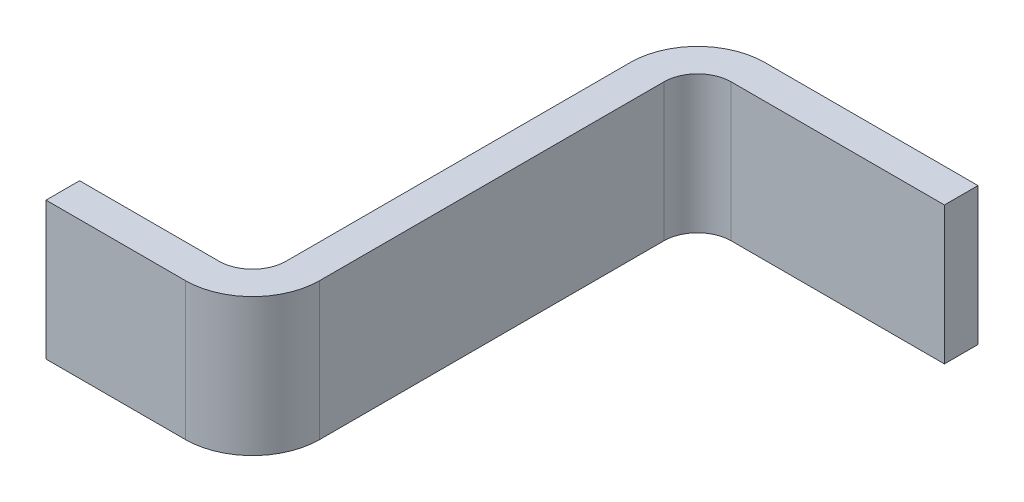
ISO-10303-21;
HEADER;
FILE_DESCRIPTION(('STEP AP214'),'2;1');
FILE_NAME('part.step','',(''),(''),'','','');
FILE_SCHEMA(('AUTOMOTIVE_DESIGN { 1 0 10303 214 1 1 1 1 }'));
ENDSEC;
DATA;
#1=APPLICATION_CONTEXT('core data for automotive mechanical design processes');
#2=APPLICATION_PROTOCOL_DEFINITION('international standard','automotive_design',2000,#1);
#3=PRODUCT_CONTEXT('',#1,'mechanical');
#4=PRODUCT('Part','Part','',(#3));
#5=PRODUCT_RELATED_PRODUCT_CATEGORY('part','',(#4));
#6=PRODUCT_DEFINITION_FORMATION('','',#4);
#7=PRODUCT_DEFINITION_CONTEXT('part definition',#1,'design');
#8=PRODUCT_DEFINITION('design','',#6,#7);
#9=PRODUCT_DEFINITION_SHAPE('','',#8);
#10=(LENGTH_UNIT() NAMED_UNIT(*) SI_UNIT(.MILLI.,.METRE.));
#11=(NAMED_UNIT(*) PLANE_ANGLE_UNIT() SI_UNIT($,.RADIAN.));
#12=(NAMED_UNIT(*) SI_UNIT($,.STERADIAN.) SOLID_ANGLE_UNIT());
#13=UNCERTAINTY_MEASURE_WITH_UNIT(LENGTH_MEASURE(1.E-05),#10,'distance_accuracy_value','');
#14=(GEOMETRIC_REPRESENTATION_CONTEXT(3) GLOBAL_UNCERTAINTY_ASSIGNED_CONTEXT((#13)) GLOBAL_UNIT_ASSIGNED_CONTEXT((#10,
#11,#12)) REPRESENTATION_CONTEXT('',''));
#15=CARTESIAN_POINT('',(0.,0.,0.));
#16=DIRECTION('',(0.,0.,1.));
#17=DIRECTION('',(1.,0.,0.));
#18=AXIS2_PLACEMENT_3D('',#15,#16,#17);
#19=CARTESIAN_POINT('',(0.,0.205,1.425));
#20=DIRECTION('',(0.,0.,-1.));
#21=DIRECTION('',(-1.,0.,0.));
#22=AXIS2_PLACEMENT_3D('',#19,#20,#21);
#23=PLANE('',#22);
#24=DIRECTION('',(1.,0.,0.));
#25=VECTOR('',#24,1.);
#26=CARTESIAN_POINT('',(0.,0.205,1.425));
#27=LINE('',#26,#25);
#28=CARTESIAN_POINT('',(0.415,0.205,1.425));
#29=VERTEX_POINT('',#28);
#30=CARTESIAN_POINT('',(0.,0.205,1.425));
#31=VERTEX_POINT('',#30);
#32=EDGE_CURVE('E85',#29,#31,#27,.F.);
#33=ORIENTED_EDGE('',*,*,#32,.T.);
#34=DIRECTION('',(0.,1.,0.));
#35=VECTOR('',#34,1.);
#36=CARTESIAN_POINT('',(0.,-0.205,1.425));
#37=LINE('',#36,#35);
#38=CARTESIAN_POINT('',(0.,-0.205,1.425));
#39=VERTEX_POINT('',#38);
#40=EDGE_CURVE('E111',#39,#31,#37,.T.);
#41=ORIENTED_EDGE('',*,*,#40,.F.);
#42=DIRECTION('',(1.,0.,0.));
#43=VECTOR('',#42,1.);
#44=CARTESIAN_POINT('',(0.,-0.205,1.425));
#45=LINE('',#44,#43);
#46=CARTESIAN_POINT('',(0.415,-0.205,1.425));
#47=VERTEX_POINT('',#46);
#48=EDGE_CURVE('E130',#39,#47,#45,.T.);
#49=ORIENTED_EDGE('',*,*,#48,.T.);
#50=DIRECTION('',(0.,1.,0.));
#51=VECTOR('',#50,1.);
#52=CARTESIAN_POINT('',(0.415,0.205,1.425));
#53=LINE('',#52,#51);
#54=EDGE_CURVE('E121',#29,#47,#53,.F.);
#55=ORIENTED_EDGE('',*,*,#54,.F.);
#56=EDGE_LOOP('',(#33,#41,#49,#55));
#57=FACE_BOUND('',#56,.T.);
#58=ADVANCED_FACE('F17',(#57),#23,.F.);
#59=CARTESIAN_POINT('',(0.715,0.205,0.1));
#60=DIRECTION('',(0.,0.,-1.));
#61=DIRECTION('',(-1.,0.,0.));
#62=AXIS2_PLACEMENT_3D('',#59,#60,#61);
#63=PLANE('',#62);
#64=DIRECTION('',(1.,0.,0.));
#65=VECTOR('',#64,1.);
#66=CARTESIAN_POINT('',(0.715,0.205,0.1));
#67=LINE('',#66,#65);
#68=CARTESIAN_POINT('',(1.35,0.205,0.1));
#69=VERTEX_POINT('',#68);
#70=CARTESIAN_POINT('',(0.715,0.205,0.1));
#71=VERTEX_POINT('',#70);
#72=EDGE_CURVE('E142',#69,#71,#67,.F.);
#73=ORIENTED_EDGE('',*,*,#72,.T.);
#74=DIRECTION('',(0.,-1.,0.));
#75=VECTOR('',#74,1.);
#76=CARTESIAN_POINT('',(0.715,0.205,0.1));
#77=LINE('',#76,#75);
#78=CARTESIAN_POINT('',(0.715,-0.205,0.1));
#79=VERTEX_POINT('',#78);
#80=EDGE_CURVE('E189',#71,#79,#77,.T.);
#81=ORIENTED_EDGE('',*,*,#80,.T.);
#82=DIRECTION('',(1.,0.,0.));
#83=VECTOR('',#82,1.);
#84=CARTESIAN_POINT('',(0.715,-0.205,0.1));
#85=LINE('',#84,#83);
#86=CARTESIAN_POINT('',(1.35,-0.205,0.1));
#87=VERTEX_POINT('',#86);
#88=EDGE_CURVE('E193',#79,#87,#85,.T.);
#89=ORIENTED_EDGE('',*,*,#88,.T.);
#90=DIRECTION('',(0.,1.,0.));
#91=VECTOR('',#90,1.);
#92=CARTESIAN_POINT('',(1.35,-0.205,0.1));
#93=LINE('',#92,#91);
#94=EDGE_CURVE('E96',#87,#69,#93,.T.);
#95=ORIENTED_EDGE('',*,*,#94,.T.);
#96=EDGE_LOOP('',(#73,#81,#89,#95));
#97=FACE_BOUND('',#96,.T.);
#98=ADVANCED_FACE('F230',(#97),#63,.F.);
#99=CARTESIAN_POINT('',(0.,-0.205,1.325));
#100=DIRECTION('',(-1.,0.,0.));
#101=DIRECTION('',(0.,0.,1.));
#102=AXIS2_PLACEMENT_3D('',#99,#100,#101);
#103=PLANE('',#102);
#104=DIRECTION('',(0.,0.,1.));
#105=VECTOR('',#104,1.);
#106=CARTESIAN_POINT('',(0.,0.205,1.325));
#107=LINE('',#106,#105);
#108=CARTESIAN_POINT('',(0.,0.205,1.325));
#109=VERTEX_POINT('',#108);
#110=EDGE_CURVE('E114',#31,#109,#107,.F.);
#111=ORIENTED_EDGE('',*,*,#110,.T.);
#112=DIRECTION('',(0.,1.,0.));
#113=VECTOR('',#112,1.);
#114=CARTESIAN_POINT('',(0.,-0.205,1.325));
#115=LINE('',#114,#113);
#116=CARTESIAN_POINT('',(0.,-0.205,1.325));
#117=VERTEX_POINT('',#116);
#118=EDGE_CURVE('E175',#109,#117,#115,.F.);
#119=ORIENTED_EDGE('',*,*,#118,.T.);
#120=DIRECTION('',(0.,0.,1.));
#121=VECTOR('',#120,1.);
#122=CARTESIAN_POINT('',(0.,-0.205,1.425));
#123=LINE('',#122,#121);
#124=EDGE_CURVE('E116',#117,#39,#123,.T.);
#125=ORIENTED_EDGE('',*,*,#124,.T.);
#126=ORIENTED_EDGE('',*,*,#40,.T.);
#127=EDGE_LOOP('',(#111,#119,#125,#126));
#128=FACE_BOUND('',#127,.T.);
#129=ADVANCED_FACE('F112',(#128),#103,.T.);
#130=CARTESIAN_POINT('',(0.415,0.205,1.225));
#131=DIRECTION('',(0.,1.,0.));
#132=DIRECTION('',(0.,0.,1.));
#133=AXIS2_PLACEMENT_3D('',#130,#131,#132);
#134=CYLINDRICAL_SURFACE('',#133,0.2);
#135=CARTESIAN_POINT('',(0.415,0.205,1.225));
#136=DIRECTION('',(0.,1.,0.));
#137=DIRECTION('',(0.,0.,1.));
#138=AXIS2_PLACEMENT_3D('',#135,#136,#137);
#139=CIRCLE('',#138,0.2);
#140=CARTESIAN_POINT('',(0.615,0.205,1.225));
#141=VERTEX_POINT('',#140);
#142=EDGE_CURVE('E20',#29,#141,#139,.T.);
#143=ORIENTED_EDGE('',*,*,#142,.F.);
#144=ORIENTED_EDGE('',*,*,#54,.T.);
#145=CARTESIAN_POINT('',(0.415,-0.205,1.225));
#146=DIRECTION('',(0.,1.,0.));
#147=DIRECTION('',(0.,0.,1.));
#148=AXIS2_PLACEMENT_3D('',#145,#146,#147);
#149=CIRCLE('',#148,0.2);
#150=CARTESIAN_POINT('',(0.615,-0.205,1.225));
#151=VERTEX_POINT('',#150);
#152=EDGE_CURVE('E166',#151,#47,#149,.F.);
#153=ORIENTED_EDGE('',*,*,#152,.F.);
#154=DIRECTION('',(0.,1.,0.));
#155=VECTOR('',#154,1.);
#156=CARTESIAN_POINT('',(0.615,0.205,1.225));
#157=LINE('',#156,#155);
#158=EDGE_CURVE('E168',#151,#141,#157,.T.);
#159=ORIENTED_EDGE('',*,*,#158,.T.);
#160=EDGE_LOOP('',(#143,#144,#153,#159));
#161=FACE_BOUND('',#160,.T.);
#162=ADVANCED_FACE('F220',(#161),#134,.T.);
#163=CARTESIAN_POINT('',(1.35,-0.205,0.));
#164=DIRECTION('',(-1.,0.,0.));
#165=DIRECTION('',(0.,0.,1.));
#166=AXIS2_PLACEMENT_3D('',#163,#164,#165);
#167=PLANE('',#166);
#168=DIRECTION('',(0.,0.,1.));
#169=VECTOR('',#168,1.);
#170=CARTESIAN_POINT('',(1.35,0.205,0.));
#171=LINE('',#170,#169);
#172=CARTESIAN_POINT('',(1.35,0.205,0.));
#173=VERTEX_POINT('',#172);
#174=EDGE_CURVE('E141',#69,#173,#171,.F.);
#175=ORIENTED_EDGE('',*,*,#174,.F.);
#176=ORIENTED_EDGE('',*,*,#94,.F.);
#177=DIRECTION('',(0.,0.,1.));
#178=VECTOR('',#177,1.);
#179=CARTESIAN_POINT('',(1.35,-0.205,0.1));
#180=LINE('',#179,#178);
#181=CARTESIAN_POINT('',(1.35,-0.205,0.));
#182=VERTEX_POINT('',#181);
#183=EDGE_CURVE('E192',#87,#182,#180,.F.);
#184=ORIENTED_EDGE('',*,*,#183,.T.);
#185=DIRECTION('',(0.,1.,0.));
#186=VECTOR('',#185,1.);
#187=CARTESIAN_POINT('',(1.35,-0.205,0.));
#188=LINE('',#187,#186);
#189=EDGE_CURVE('E161',#182,#173,#188,.T.);
#190=ORIENTED_EDGE('',*,*,#189,.T.);
#191=EDGE_LOOP('',(#175,#176,#184,#190));
#192=FACE_BOUND('',#191,.T.);
#193=ADVANCED_FACE('F232',(#192),#167,.F.);
#194=CARTESIAN_POINT('',(0.715,0.205,0.2));
#195=DIRECTION('',(0.,-1.,0.));
#196=DIRECTION('',(0.,0.,-1.));
#197=AXIS2_PLACEMENT_3D('',#194,#195,#196);
#198=CYLINDRICAL_SURFACE('',#197,0.1);
#199=CARTESIAN_POINT('',(0.715,0.205,0.2));
#200=DIRECTION('',(0.,-1.,0.));
#201=DIRECTION('',(0.,0.,-1.));
#202=AXIS2_PLACEMENT_3D('',#199,#200,#201);
#203=CIRCLE('',#202,0.1);
#204=CARTESIAN_POINT('',(0.615,0.205,0.2));
#205=VERTEX_POINT('',#204);
#206=EDGE_CURVE('E162',#205,#71,#203,.T.);
#207=ORIENTED_EDGE('',*,*,#206,.F.);
#208=DIRECTION('',(0.,1.,0.));
#209=VECTOR('',#208,1.);
#210=CARTESIAN_POINT('',(0.615,0.205,0.2));
#211=LINE('',#210,#209);
#212=CARTESIAN_POINT('',(0.615,-0.205,0.2));
#213=VERTEX_POINT('',#212);
#214=EDGE_CURVE('E165',#205,#213,#211,.F.);
#215=ORIENTED_EDGE('',*,*,#214,.T.);
#216=CARTESIAN_POINT('',(0.715,-0.205,0.2));
#217=DIRECTION('',(0.,-1.,0.));
#218=DIRECTION('',(0.,0.,-1.));
#219=AXIS2_PLACEMENT_3D('',#216,#217,#218);
#220=CIRCLE('',#219,0.1);
#221=EDGE_CURVE('E159',#79,#213,#220,.F.);
#222=ORIENTED_EDGE('',*,*,#221,.F.);
#223=ORIENTED_EDGE('',*,*,#80,.F.);
#224=EDGE_LOOP('',(#207,#215,#222,#223));
#225=FACE_BOUND('',#224,.T.);
#226=ADVANCED_FACE('F226',(#225),#198,.F.);
#227=CARTESIAN_POINT('',(0.,-0.205,1.325));
#228=DIRECTION('',(0.,0.,1.));
#229=DIRECTION('',(1.,0.,0.));
#230=AXIS2_PLACEMENT_3D('',#227,#228,#229);
#231=PLANE('',#230);
#232=DIRECTION('',(1.,0.,0.));
#233=VECTOR('',#232,1.);
#234=CARTESIAN_POINT('',(0.,-0.205,1.325));
#235=LINE('',#234,#233);
#236=CARTESIAN_POINT('',(0.415,-0.205,1.325));
#237=VERTEX_POINT('',#236);
#238=EDGE_CURVE('E169',#117,#237,#235,.T.);
#239=ORIENTED_EDGE('',*,*,#238,.F.);
#240=ORIENTED_EDGE('',*,*,#118,.F.);
#241=DIRECTION('',(1.,0.,0.));
#242=VECTOR('',#241,1.);
#243=CARTESIAN_POINT('',(0.,0.205,1.325));
#244=LINE('',#243,#242);
#245=CARTESIAN_POINT('',(0.415,0.205,1.325));
#246=VERTEX_POINT('',#245);
#247=EDGE_CURVE('E128',#246,#109,#244,.F.);
#248=ORIENTED_EDGE('',*,*,#247,.F.);
#249=DIRECTION('',(0.,1.,0.));
#250=VECTOR('',#249,1.);
#251=CARTESIAN_POINT('',(0.415,-0.205,1.325));
#252=LINE('',#251,#250);
#253=EDGE_CURVE('E155',#246,#237,#252,.F.);
#254=ORIENTED_EDGE('',*,*,#253,.T.);
#255=EDGE_LOOP('',(#239,#240,#248,#254));
#256=FACE_BOUND('',#255,.T.);
#257=ADVANCED_FACE('F266',(#256),#231,.F.);
#258=CARTESIAN_POINT('',(0.615,0.205,1.225));
#259=DIRECTION('',(-1.,0.,0.));
#260=DIRECTION('',(0.,0.,1.));
#261=AXIS2_PLACEMENT_3D('',#258,#259,#260);
#262=PLANE('',#261);
#263=DIRECTION('',(0.,0.,-1.));
#264=VECTOR('',#263,1.);
#265=CARTESIAN_POINT('',(0.615,0.205,1.225));
#266=LINE('',#265,#264);
#267=EDGE_CURVE('E158',#205,#141,#266,.F.);
#268=ORIENTED_EDGE('',*,*,#267,.T.);
#269=ORIENTED_EDGE('',*,*,#158,.F.);
#270=DIRECTION('',(0.,0.,1.));
#271=VECTOR('',#270,1.);
#272=CARTESIAN_POINT('',(0.615,-0.205,1.225));
#273=LINE('',#272,#271);
#274=EDGE_CURVE('E152',#151,#213,#273,.F.);
#275=ORIENTED_EDGE('',*,*,#274,.T.);
#276=ORIENTED_EDGE('',*,*,#214,.F.);
#277=EDGE_LOOP('',(#268,#269,#275,#276));
#278=FACE_BOUND('',#277,.T.);
#279=ADVANCED_FACE('F268',(#278),#262,.F.);
#280=CARTESIAN_POINT('',(0.715,-0.205,0.));
#281=DIRECTION('',(0.,0.,1.));
#282=DIRECTION('',(1.,0.,0.));
#283=AXIS2_PLACEMENT_3D('',#280,#281,#282);
#284=PLANE('',#283);
#285=DIRECTION('',(1.,0.,0.));
#286=VECTOR('',#285,1.);
#287=CARTESIAN_POINT('',(0.715,-0.205,0.));
#288=LINE('',#287,#286);
#289=CARTESIAN_POINT('',(0.715,-0.205,0.));
#290=VERTEX_POINT('',#289);
#291=EDGE_CURVE('E203',#290,#182,#288,.T.);
#292=ORIENTED_EDGE('',*,*,#291,.F.);
#293=DIRECTION('',(0.,-1.,0.));
#294=VECTOR('',#293,1.);
#295=CARTESIAN_POINT('',(0.715,-0.205,0.));
#296=LINE('',#295,#294);
#297=CARTESIAN_POINT('',(0.715,0.205,0.));
#298=VERTEX_POINT('',#297);
#299=EDGE_CURVE('E149',#298,#290,#296,.T.);
#300=ORIENTED_EDGE('',*,*,#299,.F.);
#301=DIRECTION('',(1.,0.,0.));
#302=VECTOR('',#301,1.);
#303=CARTESIAN_POINT('',(0.715,0.205,0.));
#304=LINE('',#303,#302);
#305=EDGE_CURVE('E164',#173,#298,#304,.F.);
#306=ORIENTED_EDGE('',*,*,#305,.F.);
#307=ORIENTED_EDGE('',*,*,#189,.F.);
#308=EDGE_LOOP('',(#292,#300,#306,#307));
#309=FACE_BOUND('',#308,.T.);
#310=ADVANCED_FACE('F238',(#309),#284,.F.);
#311=CARTESIAN_POINT('',(0.515,0.205,1.225));
#312=DIRECTION('',(0.,-1.,0.));
#313=DIRECTION('',(0.,0.,-1.));
#314=AXIS2_PLACEMENT_3D('',#311,#312,#313);
#315=PLANE('',#314);
#316=DIRECTION('',(0.,0.,-1.));
#317=VECTOR('',#316,1.);
#318=CARTESIAN_POINT('',(0.515,0.205,1.225));
#319=LINE('',#318,#317);
#320=CARTESIAN_POINT('',(0.515,0.205,0.2));
#321=VERTEX_POINT('',#320);
#322=CARTESIAN_POINT('',(0.515,0.205,1.225));
#323=VERTEX_POINT('',#322);
#324=EDGE_CURVE('E148',#321,#323,#319,.F.);
#325=ORIENTED_EDGE('',*,*,#324,.T.);
#326=CARTESIAN_POINT('',(0.415,0.205,1.225));
#327=DIRECTION('',(0.,1.,0.));
#328=DIRECTION('',(0.,0.,1.));
#329=AXIS2_PLACEMENT_3D('',#326,#327,#328);
#330=CIRCLE('',#329,0.1);
#331=EDGE_CURVE('E156',#323,#246,#330,.F.);
#332=ORIENTED_EDGE('',*,*,#331,.T.);
#333=ORIENTED_EDGE('',*,*,#247,.T.);
#334=ORIENTED_EDGE('',*,*,#110,.F.);
#335=ORIENTED_EDGE('',*,*,#32,.F.);
#336=ORIENTED_EDGE('',*,*,#142,.T.);
#337=ORIENTED_EDGE('',*,*,#267,.F.);
#338=ORIENTED_EDGE('',*,*,#206,.T.);
#339=ORIENTED_EDGE('',*,*,#72,.F.);
#340=ORIENTED_EDGE('',*,*,#174,.T.);
#341=ORIENTED_EDGE('',*,*,#305,.T.);
#342=CARTESIAN_POINT('',(0.715,0.205,0.2));
#343=DIRECTION('',(0.,-1.,0.));
#344=DIRECTION('',(0.,0.,-1.));
#345=AXIS2_PLACEMENT_3D('',#342,#343,#344);
#346=CIRCLE('',#345,0.2);
#347=EDGE_CURVE('E150',#321,#298,#346,.T.);
#348=ORIENTED_EDGE('',*,*,#347,.F.);
#349=EDGE_LOOP('',(#325,#332,#333,#334,#335,#336,#337,#338,#339,#340,#341,#348));
#350=FACE_BOUND('',#349,.T.);
#351=ADVANCED_FACE('F126',(#350),#315,.F.);
#352=CARTESIAN_POINT('',(0.415,-0.205,1.225));
#353=DIRECTION('',(0.,1.,0.));
#354=DIRECTION('',(0.,0.,1.));
#355=AXIS2_PLACEMENT_3D('',#352,#353,#354);
#356=CYLINDRICAL_SURFACE('',#355,0.1);
#357=CARTESIAN_POINT('',(0.415,-0.205,1.225));
#358=DIRECTION('',(0.,1.,0.));
#359=DIRECTION('',(0.,0.,1.));
#360=AXIS2_PLACEMENT_3D('',#357,#358,#359);
#361=CIRCLE('',#360,0.1);
#362=CARTESIAN_POINT('',(0.515,-0.205,1.225));
#363=VERTEX_POINT('',#362);
#364=EDGE_CURVE('E153',#237,#363,#361,.T.);
#365=ORIENTED_EDGE('',*,*,#364,.F.);
#366=ORIENTED_EDGE('',*,*,#253,.F.);
#367=ORIENTED_EDGE('',*,*,#331,.F.);
#368=DIRECTION('',(0.,1.,0.));
#369=VECTOR('',#368,1.);
#370=CARTESIAN_POINT('',(0.515,-0.205,1.225));
#371=LINE('',#370,#369);
#372=EDGE_CURVE('E251',#323,#363,#371,.F.);
#373=ORIENTED_EDGE('',*,*,#372,.T.);
#374=EDGE_LOOP('',(#365,#366,#367,#373));
#375=FACE_BOUND('',#374,.T.);
#376=ADVANCED_FACE('F263',(#375),#356,.F.);
#377=CARTESIAN_POINT('',(0.615,-0.205,1.225));
#378=DIRECTION('',(0.,1.,0.));
#379=DIRECTION('',(0.,0.,1.));
#380=AXIS2_PLACEMENT_3D('',#377,#378,#379);
#381=PLANE('',#380);
#382=ORIENTED_EDGE('',*,*,#274,.F.);
#383=ORIENTED_EDGE('',*,*,#152,.T.);
#384=ORIENTED_EDGE('',*,*,#48,.F.);
#385=ORIENTED_EDGE('',*,*,#124,.F.);
#386=ORIENTED_EDGE('',*,*,#238,.T.);
#387=ORIENTED_EDGE('',*,*,#364,.T.);
#388=DIRECTION('',(0.,0.,-1.));
#389=VECTOR('',#388,1.);
#390=CARTESIAN_POINT('',(0.515,-0.205,1.225));
#391=LINE('',#390,#389);
#392=CARTESIAN_POINT('',(0.515,-0.205,0.2));
#393=VERTEX_POINT('',#392);
#394=EDGE_CURVE('E26',#363,#393,#391,.T.);
#395=ORIENTED_EDGE('',*,*,#394,.T.);
#396=CARTESIAN_POINT('',(0.715,-0.205,0.2));
#397=DIRECTION('',(0.,-1.,0.));
#398=DIRECTION('',(0.,0.,-1.));
#399=AXIS2_PLACEMENT_3D('',#396,#397,#398);
#400=CIRCLE('',#399,0.2);
#401=EDGE_CURVE('E34',#290,#393,#400,.F.);
#402=ORIENTED_EDGE('',*,*,#401,.F.);
#403=ORIENTED_EDGE('',*,*,#291,.T.);
#404=ORIENTED_EDGE('',*,*,#183,.F.);
#405=ORIENTED_EDGE('',*,*,#88,.F.);
#406=ORIENTED_EDGE('',*,*,#221,.T.);
#407=EDGE_LOOP('',(#382,#383,#384,#385,#386,#387,#395,#402,#403,#404,#405,#406));
#408=FACE_BOUND('',#407,.T.);
#409=ADVANCED_FACE('F240',(#408),#381,.F.);
#410=CARTESIAN_POINT('',(0.715,-0.205,0.2));
#411=DIRECTION('',(0.,-1.,0.));
#412=DIRECTION('',(0.,0.,-1.));
#413=AXIS2_PLACEMENT_3D('',#410,#411,#412);
#414=CYLINDRICAL_SURFACE('',#413,0.2);
#415=ORIENTED_EDGE('',*,*,#401,.T.);
#416=DIRECTION('',(0.,1.,0.));
#417=VECTOR('',#416,1.);
#418=CARTESIAN_POINT('',(0.515,-0.205,0.2));
#419=LINE('',#418,#417);
#420=EDGE_CURVE('E11',#393,#321,#419,.T.);
#421=ORIENTED_EDGE('',*,*,#420,.T.);
#422=ORIENTED_EDGE('',*,*,#347,.T.);
#423=ORIENTED_EDGE('',*,*,#299,.T.);
#424=EDGE_LOOP('',(#415,#421,#422,#423));
#425=FACE_BOUND('',#424,.T.);
#426=ADVANCED_FACE('F260',(#425),#414,.T.);
#427=CARTESIAN_POINT('',(0.515,-0.205,1.225));
#428=DIRECTION('',(1.,0.,0.));
#429=DIRECTION('',(0.,0.,-1.));
#430=AXIS2_PLACEMENT_3D('',#427,#428,#429);
#431=PLANE('',#430);
#432=ORIENTED_EDGE('',*,*,#394,.F.);
#433=ORIENTED_EDGE('',*,*,#372,.F.);
#434=ORIENTED_EDGE('',*,*,#324,.F.);
#435=ORIENTED_EDGE('',*,*,#420,.F.);
#436=EDGE_LOOP('',(#432,#433,#434,#435));
#437=FACE_BOUND('',#436,.T.);
#438=ADVANCED_FACE('F258',(#437),#431,.F.);
#439=CLOSED_SHELL('',(#58,#98,#129,#162,#193,#226,#257,#279,#310,#351,#376,#409,#426,#438));
#440=MANIFOLD_SOLID_BREP('B1',#439);
#441=ADVANCED_BREP_SHAPE_REPRESENTATION('',(#18,#440),#14);
#442=SHAPE_DEFINITION_REPRESENTATION(#9,#441);
ENDSEC;
END-ISO-10303-21;
